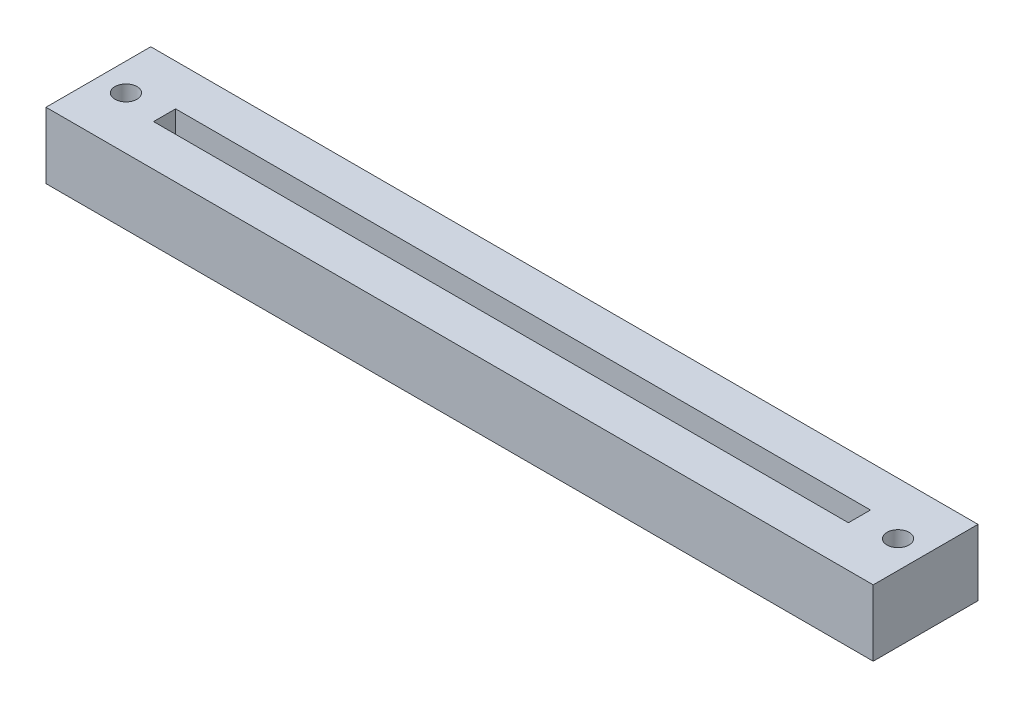
ISO-10303-21;
HEADER;
FILE_DESCRIPTION(('STEP AP214'),'2;1');
FILE_NAME('part.step','',(''),(''),'','','');
FILE_SCHEMA(('AUTOMOTIVE_DESIGN { 1 0 10303 214 1 1 1 1 }'));
ENDSEC;
DATA;
#1=APPLICATION_CONTEXT('core data for automotive mechanical design processes');
#2=APPLICATION_PROTOCOL_DEFINITION('international standard','automotive_design',2000,#1);
#3=PRODUCT_CONTEXT('',#1,'mechanical');
#4=PRODUCT('Part','Part','',(#3));
#5=PRODUCT_RELATED_PRODUCT_CATEGORY('part','',(#4));
#6=PRODUCT_DEFINITION_FORMATION('','',#4);
#7=PRODUCT_DEFINITION_CONTEXT('part definition',#1,'design');
#8=PRODUCT_DEFINITION('design','',#6,#7);
#9=PRODUCT_DEFINITION_SHAPE('','',#8);
#10=(LENGTH_UNIT() NAMED_UNIT(*) SI_UNIT(.MILLI.,.METRE.));
#11=(NAMED_UNIT(*) PLANE_ANGLE_UNIT() SI_UNIT($,.RADIAN.));
#12=(NAMED_UNIT(*) SI_UNIT($,.STERADIAN.) SOLID_ANGLE_UNIT());
#13=UNCERTAINTY_MEASURE_WITH_UNIT(LENGTH_MEASURE(1.E-05),#10,'distance_accuracy_value','');
#14=(GEOMETRIC_REPRESENTATION_CONTEXT(3) GLOBAL_UNCERTAINTY_ASSIGNED_CONTEXT((#13)) GLOBAL_UNIT_ASSIGNED_CONTEXT((#10,
#11,#12)) REPRESENTATION_CONTEXT('',''));
#15=CARTESIAN_POINT('',(0.,0.,0.));
#16=DIRECTION('',(0.,0.,1.));
#17=DIRECTION('',(1.,0.,0.));
#18=AXIS2_PLACEMENT_3D('',#15,#16,#17);
#19=CARTESIAN_POINT('',(0.,6.,0.));
#20=DIRECTION('',(1.,0.,0.));
#21=DIRECTION('',(0.,0.,-1.));
#22=AXIS2_PLACEMENT_3D('',#19,#20,#21);
#23=PLANE('',#22);
#24=DIRECTION('',(0.,0.,1.));
#25=VECTOR('',#24,1.);
#26=CARTESIAN_POINT('',(0.,0.,0.));
#27=LINE('',#26,#25);
#28=CARTESIAN_POINT('',(0.,0.,-9.5));
#29=VERTEX_POINT('',#28);
#30=CARTESIAN_POINT('',(0.,0.,0.));
#31=VERTEX_POINT('',#30);
#32=EDGE_CURVE('E155',#29,#31,#27,.T.);
#33=ORIENTED_EDGE('',*,*,#32,.T.);
#34=DIRECTION('',(0.,-1.,0.));
#35=VECTOR('',#34,1.);
#36=CARTESIAN_POINT('',(0.,6.,0.));
#37=LINE('',#36,#35);
#38=CARTESIAN_POINT('',(0.,6.,0.));
#39=VERTEX_POINT('',#38);
#40=EDGE_CURVE('E11',#39,#31,#37,.T.);
#41=ORIENTED_EDGE('',*,*,#40,.F.);
#42=DIRECTION('',(0.,0.,1.));
#43=VECTOR('',#42,1.);
#44=CARTESIAN_POINT('',(0.,6.,0.));
#45=LINE('',#44,#43);
#46=CARTESIAN_POINT('',(0.,6.,-9.5));
#47=VERTEX_POINT('',#46);
#48=EDGE_CURVE('E158',#47,#39,#45,.T.);
#49=ORIENTED_EDGE('',*,*,#48,.F.);
#50=DIRECTION('',(0.,-1.,0.));
#51=VECTOR('',#50,1.);
#52=CARTESIAN_POINT('',(0.,6.,-9.5));
#53=LINE('',#52,#51);
#54=EDGE_CURVE('E164',#47,#29,#53,.T.);
#55=ORIENTED_EDGE('',*,*,#54,.T.);
#56=EDGE_LOOP('',(#33,#41,#49,#55));
#57=FACE_BOUND('',#56,.T.);
#58=ADVANCED_FACE('F34',(#57),#23,.F.);
#59=CARTESIAN_POINT('',(0.,6.,0.));
#60=DIRECTION('',(0.,0.,-1.));
#61=DIRECTION('',(-1.,0.,0.));
#62=AXIS2_PLACEMENT_3D('',#59,#60,#61);
#63=PLANE('',#62);
#64=DIRECTION('',(1.,0.,0.));
#65=VECTOR('',#64,1.);
#66=CARTESIAN_POINT('',(0.,0.,0.));
#67=LINE('',#66,#65);
#68=CARTESIAN_POINT('',(75.,0.,0.));
#69=VERTEX_POINT('',#68);
#70=EDGE_CURVE('E167',#31,#69,#67,.T.);
#71=ORIENTED_EDGE('',*,*,#70,.T.);
#72=DIRECTION('',(0.,-1.,0.));
#73=VECTOR('',#72,1.);
#74=CARTESIAN_POINT('',(75.,6.,0.));
#75=LINE('',#74,#73);
#76=CARTESIAN_POINT('',(75.,6.,0.));
#77=VERTEX_POINT('',#76);
#78=EDGE_CURVE('E41',#77,#69,#75,.T.);
#79=ORIENTED_EDGE('',*,*,#78,.F.);
#80=DIRECTION('',(1.,0.,0.));
#81=VECTOR('',#80,1.);
#82=CARTESIAN_POINT('',(0.,6.,0.));
#83=LINE('',#82,#81);
#84=EDGE_CURVE('E85',#39,#77,#83,.T.);
#85=ORIENTED_EDGE('',*,*,#84,.F.);
#86=ORIENTED_EDGE('',*,*,#40,.T.);
#87=EDGE_LOOP('',(#71,#79,#85,#86));
#88=FACE_BOUND('',#87,.T.);
#89=ADVANCED_FACE('F197',(#88),#63,.F.);
#90=CARTESIAN_POINT('',(75.,6.,0.));
#91=DIRECTION('',(-1.,0.,0.));
#92=DIRECTION('',(0.,0.,1.));
#93=AXIS2_PLACEMENT_3D('',#90,#91,#92);
#94=PLANE('',#93);
#95=DIRECTION('',(0.,0.,-1.));
#96=VECTOR('',#95,1.);
#97=CARTESIAN_POINT('',(75.,0.,0.));
#98=LINE('',#97,#96);
#99=CARTESIAN_POINT('',(75.,0.,-9.5));
#100=VERTEX_POINT('',#99);
#101=EDGE_CURVE('E169',#69,#100,#98,.T.);
#102=ORIENTED_EDGE('',*,*,#101,.T.);
#103=DIRECTION('',(0.,-1.,0.));
#104=VECTOR('',#103,1.);
#105=CARTESIAN_POINT('',(75.,6.,-9.5));
#106=LINE('',#105,#104);
#107=CARTESIAN_POINT('',(75.,6.,-9.5));
#108=VERTEX_POINT('',#107);
#109=EDGE_CURVE('E173',#108,#100,#106,.T.);
#110=ORIENTED_EDGE('',*,*,#109,.F.);
#111=DIRECTION('',(0.,0.,-1.));
#112=VECTOR('',#111,1.);
#113=CARTESIAN_POINT('',(75.,6.,0.));
#114=LINE('',#113,#112);
#115=EDGE_CURVE('E161',#77,#108,#114,.T.);
#116=ORIENTED_EDGE('',*,*,#115,.F.);
#117=ORIENTED_EDGE('',*,*,#78,.T.);
#118=EDGE_LOOP('',(#102,#110,#116,#117));
#119=FACE_BOUND('',#118,.T.);
#120=ADVANCED_FACE('F178',(#119),#94,.F.);
#121=CARTESIAN_POINT('',(0.,6.,-9.5));
#122=DIRECTION('',(0.,0.,1.));
#123=DIRECTION('',(1.,0.,0.));
#124=AXIS2_PLACEMENT_3D('',#121,#122,#123);
#125=PLANE('',#124);
#126=DIRECTION('',(-1.,0.,0.));
#127=VECTOR('',#126,1.);
#128=CARTESIAN_POINT('',(0.,0.,-9.5));
#129=LINE('',#128,#127);
#130=EDGE_CURVE('E78',#100,#29,#129,.T.);
#131=ORIENTED_EDGE('',*,*,#130,.T.);
#132=ORIENTED_EDGE('',*,*,#54,.F.);
#133=DIRECTION('',(-1.,0.,0.));
#134=VECTOR('',#133,1.);
#135=CARTESIAN_POINT('',(0.,6.,-9.5));
#136=LINE('',#135,#134);
#137=EDGE_CURVE('E57',#108,#47,#136,.T.);
#138=ORIENTED_EDGE('',*,*,#137,.F.);
#139=ORIENTED_EDGE('',*,*,#109,.T.);
#140=EDGE_LOOP('',(#131,#132,#138,#139));
#141=FACE_BOUND('',#140,.T.);
#142=ADVANCED_FACE('F186',(#141),#125,.F.);
#143=CARTESIAN_POINT('',(0.,6.,0.));
#144=DIRECTION('',(0.,-1.,0.));
#145=DIRECTION('',(0.,0.,-1.));
#146=AXIS2_PLACEMENT_3D('',#143,#144,#145);
#147=PLANE('',#146);
#148=DIRECTION('',(1.,0.,0.));
#149=VECTOR('',#148,1.);
#150=CARTESIAN_POINT('',(6.,6.,-3.75));
#151=LINE('',#150,#149);
#152=CARTESIAN_POINT('',(6.,6.,-3.75));
#153=VERTEX_POINT('',#152);
#154=CARTESIAN_POINT('',(69.,6.,-3.74999999999999));
#155=VERTEX_POINT('',#154);
#156=EDGE_CURVE('E136',#153,#155,#151,.T.);
#157=ORIENTED_EDGE('',*,*,#156,.F.);
#158=DIRECTION('',(0.,0.,1.));
#159=VECTOR('',#158,1.);
#160=CARTESIAN_POINT('',(6.,6.,-5.75));
#161=LINE('',#160,#159);
#162=CARTESIAN_POINT('',(6.,6.,-5.75));
#163=VERTEX_POINT('',#162);
#164=EDGE_CURVE('E48',#163,#153,#161,.T.);
#165=ORIENTED_EDGE('',*,*,#164,.F.);
#166=DIRECTION('',(-1.,0.,0.));
#167=VECTOR('',#166,1.);
#168=CARTESIAN_POINT('',(6.,6.,-5.75));
#169=LINE('',#168,#167);
#170=CARTESIAN_POINT('',(69.,6.,-5.75000000000001));
#171=VERTEX_POINT('',#170);
#172=EDGE_CURVE('E127',#171,#163,#169,.T.);
#173=ORIENTED_EDGE('',*,*,#172,.F.);
#174=DIRECTION('',(0.,0.,-1.));
#175=VECTOR('',#174,1.);
#176=CARTESIAN_POINT('',(69.,6.,-5.75000000000001));
#177=LINE('',#176,#175);
#178=EDGE_CURVE('E130',#155,#171,#177,.T.);
#179=ORIENTED_EDGE('',*,*,#178,.F.);
#180=EDGE_LOOP('',(#157,#165,#173,#179));
#181=FACE_BOUND('',#180,.T.);
#182=CARTESIAN_POINT('',(72.5,6.,-4.75));
#183=DIRECTION('',(0.,1.,0.));
#184=DIRECTION('',(0.,0.,1.));
#185=AXIS2_PLACEMENT_3D('',#182,#183,#184);
#186=CIRCLE('',#185,0.999999999999998);
#187=CARTESIAN_POINT('',(72.5,6.,-3.75));
#188=VERTEX_POINT('',#187);
#189=EDGE_CURVE('E142',#188,#188,#186,.T.);
#190=ORIENTED_EDGE('',*,*,#189,.F.);
#191=EDGE_LOOP('',(#190));
#192=FACE_BOUND('',#191,.T.);
#193=CARTESIAN_POINT('',(2.5,6.,-4.75));
#194=DIRECTION('',(0.,1.,0.));
#195=DIRECTION('',(0.,0.,1.));
#196=AXIS2_PLACEMENT_3D('',#193,#194,#195);
#197=CIRCLE('',#196,1.);
#198=CARTESIAN_POINT('',(2.5,6.,-3.75));
#199=VERTEX_POINT('',#198);
#200=EDGE_CURVE('E149',#199,#199,#197,.T.);
#201=ORIENTED_EDGE('',*,*,#200,.F.);
#202=EDGE_LOOP('',(#201));
#203=FACE_BOUND('',#202,.T.);
#204=ORIENTED_EDGE('',*,*,#48,.T.);
#205=ORIENTED_EDGE('',*,*,#84,.T.);
#206=ORIENTED_EDGE('',*,*,#115,.T.);
#207=ORIENTED_EDGE('',*,*,#137,.T.);
#208=EDGE_LOOP('',(#204,#205,#206,#207));
#209=FACE_BOUND('',#208,.T.);
#210=ADVANCED_FACE('F188',(#181,#192,#203,#209),#147,.F.);
#211=CARTESIAN_POINT('',(0.,0.,0.));
#212=DIRECTION('',(0.,-1.,0.));
#213=DIRECTION('',(0.,0.,-1.));
#214=AXIS2_PLACEMENT_3D('',#211,#212,#213);
#215=PLANE('',#214);
#216=ORIENTED_EDGE('',*,*,#32,.F.);
#217=ORIENTED_EDGE('',*,*,#130,.F.);
#218=ORIENTED_EDGE('',*,*,#101,.F.);
#219=ORIENTED_EDGE('',*,*,#70,.F.);
#220=EDGE_LOOP('',(#216,#217,#218,#219));
#221=FACE_BOUND('',#220,.T.);
#222=ADVANCED_FACE('F182',(#221),#215,.T.);
#223=CARTESIAN_POINT('',(2.5,3.,-4.75));
#224=DIRECTION('',(0.,1.,0.));
#225=DIRECTION('',(0.,0.,1.));
#226=AXIS2_PLACEMENT_3D('',#223,#224,#225);
#227=CYLINDRICAL_SURFACE('',#226,1.);
#228=CARTESIAN_POINT('',(2.5,3.,-4.75));
#229=DIRECTION('',(0.,1.,0.));
#230=DIRECTION('',(0.,0.,1.));
#231=AXIS2_PLACEMENT_3D('',#228,#229,#230);
#232=CIRCLE('',#231,1.);
#233=CARTESIAN_POINT('',(2.5,3.,-3.75));
#234=VERTEX_POINT('',#233);
#235=EDGE_CURVE('E152',#234,#234,#232,.T.);
#236=ORIENTED_EDGE('',*,*,#235,.F.);
#237=EDGE_LOOP('',(#236));
#238=FACE_BOUND('',#237,.T.);
#239=ORIENTED_EDGE('',*,*,#200,.T.);
#240=EDGE_LOOP('',(#239));
#241=FACE_BOUND('',#240,.T.);
#242=ADVANCED_FACE('F224',(#238,#241),#227,.F.);
#243=CARTESIAN_POINT('',(2.5,3.,-4.75));
#244=DIRECTION('',(0.,1.,0.));
#245=DIRECTION('',(0.,0.,1.));
#246=AXIS2_PLACEMENT_3D('',#243,#244,#245);
#247=PLANE('',#246);
#248=ORIENTED_EDGE('',*,*,#235,.T.);
#249=EDGE_LOOP('',(#248));
#250=FACE_BOUND('',#249,.T.);
#251=ADVANCED_FACE('F237',(#250),#247,.T.);
#252=CARTESIAN_POINT('',(72.5,3.,-4.75));
#253=DIRECTION('',(0.,1.,0.));
#254=DIRECTION('',(0.,0.,1.));
#255=AXIS2_PLACEMENT_3D('',#252,#253,#254);
#256=CYLINDRICAL_SURFACE('',#255,0.999999999999998);
#257=CARTESIAN_POINT('',(72.5,3.,-4.75));
#258=DIRECTION('',(0.,1.,0.));
#259=DIRECTION('',(0.,0.,1.));
#260=AXIS2_PLACEMENT_3D('',#257,#258,#259);
#261=CIRCLE('',#260,0.999999999999998);
#262=CARTESIAN_POINT('',(72.5,3.,-3.75));
#263=VERTEX_POINT('',#262);
#264=EDGE_CURVE('E146',#263,#263,#261,.T.);
#265=ORIENTED_EDGE('',*,*,#264,.F.);
#266=EDGE_LOOP('',(#265));
#267=FACE_BOUND('',#266,.T.);
#268=ORIENTED_EDGE('',*,*,#189,.T.);
#269=EDGE_LOOP('',(#268));
#270=FACE_BOUND('',#269,.T.);
#271=ADVANCED_FACE('F247',(#267,#270),#256,.F.);
#272=CARTESIAN_POINT('',(72.5,3.,-4.75));
#273=DIRECTION('',(0.,1.,0.));
#274=DIRECTION('',(0.,0.,1.));
#275=AXIS2_PLACEMENT_3D('',#272,#273,#274);
#276=PLANE('',#275);
#277=ORIENTED_EDGE('',*,*,#264,.T.);
#278=EDGE_LOOP('',(#277));
#279=FACE_BOUND('',#278,.T.);
#280=ADVANCED_FACE('F257',(#279),#276,.T.);
#281=CARTESIAN_POINT('',(6.,3.,-5.75));
#282=DIRECTION('',(-1.,0.,0.));
#283=DIRECTION('',(0.,0.,1.));
#284=AXIS2_PLACEMENT_3D('',#281,#282,#283);
#285=PLANE('',#284);
#286=ORIENTED_EDGE('',*,*,#164,.T.);
#287=DIRECTION('',(0.,1.,0.));
#288=VECTOR('',#287,1.);
#289=CARTESIAN_POINT('',(6.,3.,-3.75));
#290=LINE('',#289,#288);
#291=CARTESIAN_POINT('',(6.,3.,-3.75));
#292=VERTEX_POINT('',#291);
#293=EDGE_CURVE('E105',#292,#153,#290,.T.);
#294=ORIENTED_EDGE('',*,*,#293,.F.);
#295=DIRECTION('',(0.,0.,1.));
#296=VECTOR('',#295,1.);
#297=CARTESIAN_POINT('',(6.,3.,-5.75));
#298=LINE('',#297,#296);
#299=CARTESIAN_POINT('',(6.,3.,-5.75));
#300=VERTEX_POINT('',#299);
#301=EDGE_CURVE('E109',#300,#292,#298,.T.);
#302=ORIENTED_EDGE('',*,*,#301,.F.);
#303=DIRECTION('',(0.,1.,0.));
#304=VECTOR('',#303,1.);
#305=CARTESIAN_POINT('',(6.,3.,-5.75));
#306=LINE('',#305,#304);
#307=EDGE_CURVE('E140',#300,#163,#306,.T.);
#308=ORIENTED_EDGE('',*,*,#307,.T.);
#309=EDGE_LOOP('',(#286,#294,#302,#308));
#310=FACE_BOUND('',#309,.T.);
#311=ADVANCED_FACE('F107',(#310),#285,.F.);
#312=CARTESIAN_POINT('',(6.,3.,-5.75));
#313=DIRECTION('',(0.,0.,-1.));
#314=DIRECTION('',(-1.,0.,0.));
#315=AXIS2_PLACEMENT_3D('',#312,#313,#314);
#316=PLANE('',#315);
#317=ORIENTED_EDGE('',*,*,#172,.T.);
#318=ORIENTED_EDGE('',*,*,#307,.F.);
#319=DIRECTION('',(-1.,0.,0.));
#320=VECTOR('',#319,1.);
#321=CARTESIAN_POINT('',(6.,3.,-5.75));
#322=LINE('',#321,#320);
#323=CARTESIAN_POINT('',(69.,3.,-5.75000000000001));
#324=VERTEX_POINT('',#323);
#325=EDGE_CURVE('E115',#324,#300,#322,.T.);
#326=ORIENTED_EDGE('',*,*,#325,.F.);
#327=DIRECTION('',(0.,1.,0.));
#328=VECTOR('',#327,1.);
#329=CARTESIAN_POINT('',(69.,3.,-5.75000000000001));
#330=LINE('',#329,#328);
#331=EDGE_CURVE('E143',#324,#171,#330,.T.);
#332=ORIENTED_EDGE('',*,*,#331,.T.);
#333=EDGE_LOOP('',(#317,#318,#326,#332));
#334=FACE_BOUND('',#333,.T.);
#335=ADVANCED_FACE('F276',(#334),#316,.F.);
#336=CARTESIAN_POINT('',(69.,3.,-5.75000000000001));
#337=DIRECTION('',(1.,0.,0.));
#338=DIRECTION('',(0.,0.,-1.));
#339=AXIS2_PLACEMENT_3D('',#336,#337,#338);
#340=PLANE('',#339);
#341=ORIENTED_EDGE('',*,*,#178,.T.);
#342=ORIENTED_EDGE('',*,*,#331,.F.);
#343=DIRECTION('',(0.,0.,-1.));
#344=VECTOR('',#343,1.);
#345=CARTESIAN_POINT('',(69.,3.,-5.75000000000001));
#346=LINE('',#345,#344);
#347=CARTESIAN_POINT('',(69.,3.,-3.74999999999999));
#348=VERTEX_POINT('',#347);
#349=EDGE_CURVE('E123',#348,#324,#346,.T.);
#350=ORIENTED_EDGE('',*,*,#349,.F.);
#351=DIRECTION('',(0.,1.,0.));
#352=VECTOR('',#351,1.);
#353=CARTESIAN_POINT('',(69.,3.,-3.74999999999999));
#354=LINE('',#353,#352);
#355=EDGE_CURVE('E114',#348,#155,#354,.T.);
#356=ORIENTED_EDGE('',*,*,#355,.T.);
#357=EDGE_LOOP('',(#341,#342,#350,#356));
#358=FACE_BOUND('',#357,.T.);
#359=ADVANCED_FACE('F285',(#358),#340,.F.);
#360=CARTESIAN_POINT('',(6.,3.,-3.75));
#361=DIRECTION('',(0.,0.,1.));
#362=DIRECTION('',(1.,0.,0.));
#363=AXIS2_PLACEMENT_3D('',#360,#361,#362);
#364=PLANE('',#363);
#365=ORIENTED_EDGE('',*,*,#156,.T.);
#366=ORIENTED_EDGE('',*,*,#355,.F.);
#367=DIRECTION('',(1.,0.,0.));
#368=VECTOR('',#367,1.);
#369=CARTESIAN_POINT('',(6.,3.,-3.75));
#370=LINE('',#369,#368);
#371=EDGE_CURVE('E118',#292,#348,#370,.T.);
#372=ORIENTED_EDGE('',*,*,#371,.F.);
#373=ORIENTED_EDGE('',*,*,#293,.T.);
#374=EDGE_LOOP('',(#365,#366,#372,#373));
#375=FACE_BOUND('',#374,.T.);
#376=ADVANCED_FACE('F119',(#375),#364,.F.);
#377=CARTESIAN_POINT('',(0.,3.,0.));
#378=DIRECTION('',(0.,1.,0.));
#379=DIRECTION('',(0.,0.,1.));
#380=AXIS2_PLACEMENT_3D('',#377,#378,#379);
#381=PLANE('',#380);
#382=ORIENTED_EDGE('',*,*,#301,.T.);
#383=ORIENTED_EDGE('',*,*,#371,.T.);
#384=ORIENTED_EDGE('',*,*,#349,.T.);
#385=ORIENTED_EDGE('',*,*,#325,.T.);
#386=EDGE_LOOP('',(#382,#383,#384,#385));
#387=FACE_BOUND('',#386,.T.);
#388=ADVANCED_FACE('F125',(#387),#381,.T.);
#389=CLOSED_SHELL('',(#58,#89,#120,#142,#210,#222,#242,#251,#271,#280,#311,#335,#359,#376,#388));
#390=MANIFOLD_SOLID_BREP('B2',#389);
#391=ADVANCED_BREP_SHAPE_REPRESENTATION('',(#18,#390),#14);
#392=SHAPE_DEFINITION_REPRESENTATION(#9,#391);
ENDSEC;
END-ISO-10303-21;
